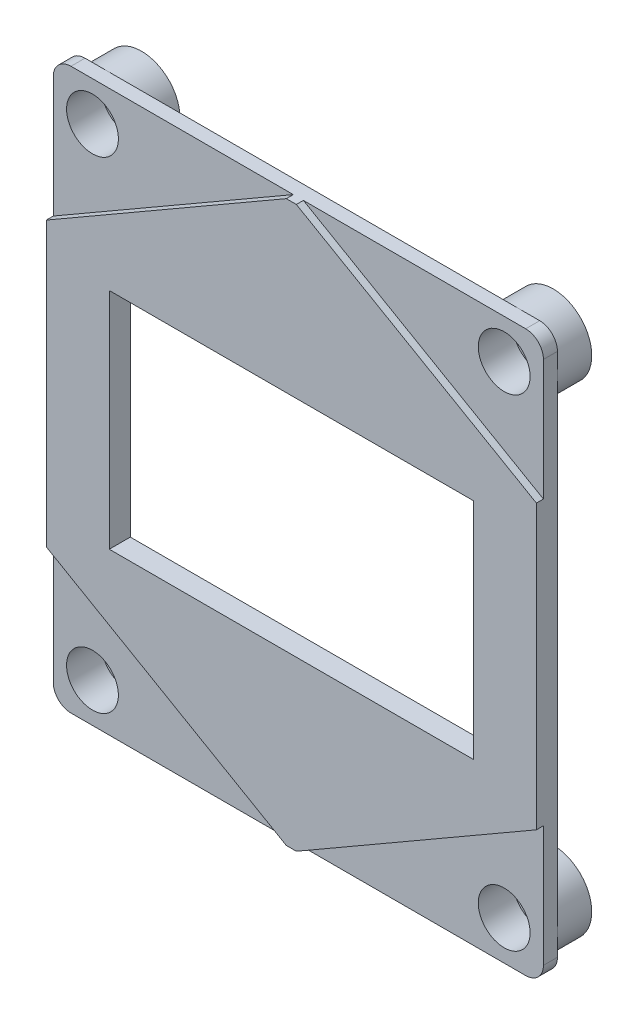
ISO-10303-21;
HEADER;
FILE_DESCRIPTION(('STEP AP214'),'2;1');
FILE_NAME('part.step','',(''),(''),'','','');
FILE_SCHEMA(('AUTOMOTIVE_DESIGN { 1 0 10303 214 1 1 1 1 }'));
ENDSEC;
DATA;
#1=APPLICATION_CONTEXT('core data for automotive mechanical design processes');
#2=APPLICATION_PROTOCOL_DEFINITION('international standard','automotive_design',2000,#1);
#3=PRODUCT_CONTEXT('',#1,'mechanical');
#4=PRODUCT('Part','Part','',(#3));
#5=PRODUCT_RELATED_PRODUCT_CATEGORY('part','',(#4));
#6=PRODUCT_DEFINITION_FORMATION('','',#4);
#7=PRODUCT_DEFINITION_CONTEXT('part definition',#1,'design');
#8=PRODUCT_DEFINITION('design','',#6,#7);
#9=PRODUCT_DEFINITION_SHAPE('','',#8);
#10=(LENGTH_UNIT() NAMED_UNIT(*) SI_UNIT(.MILLI.,.METRE.));
#11=(NAMED_UNIT(*) PLANE_ANGLE_UNIT() SI_UNIT($,.RADIAN.));
#12=(NAMED_UNIT(*) SI_UNIT($,.STERADIAN.) SOLID_ANGLE_UNIT());
#13=UNCERTAINTY_MEASURE_WITH_UNIT(LENGTH_MEASURE(1.E-05),#10,'distance_accuracy_value','');
#14=(GEOMETRIC_REPRESENTATION_CONTEXT(3) GLOBAL_UNCERTAINTY_ASSIGNED_CONTEXT((#13)) GLOBAL_UNIT_ASSIGNED_CONTEXT((#10,
#11,#12)) REPRESENTATION_CONTEXT('',''));
#15=CARTESIAN_POINT('',(0.,0.,0.));
#16=DIRECTION('',(0.,0.,1.));
#17=DIRECTION('',(1.,0.,0.));
#18=AXIS2_PLACEMENT_3D('',#15,#16,#17);
#19=CARTESIAN_POINT('',(0.,0.,1.5));
#20=DIRECTION('',(0.,0.,1.));
#21=DIRECTION('',(1.,0.,0.));
#22=AXIS2_PLACEMENT_3D('',#19,#20,#21);
#23=PLANE('',#22);
#24=DIRECTION('',(0.,1.,0.));
#25=VECTOR('',#24,1.);
#26=CARTESIAN_POINT('',(13.,0.,1.5));
#27=LINE('',#26,#25);
#28=CARTESIAN_POINT('',(13.,-8.,1.5));
#29=VERTEX_POINT('',#28);
#30=CARTESIAN_POINT('',(13.,8.,1.5));
#31=VERTEX_POINT('',#30);
#32=EDGE_CURVE('E11',#29,#31,#27,.T.);
#33=ORIENTED_EDGE('',*,*,#32,.F.);
#34=DIRECTION('',(1.,0.,0.));
#35=VECTOR('',#34,1.);
#36=CARTESIAN_POINT('',(0.,-8.,1.5));
#37=LINE('',#36,#35);
#38=CARTESIAN_POINT('',(-13.,-8.,1.5));
#39=VERTEX_POINT('',#38);
#40=EDGE_CURVE('E194',#39,#29,#37,.T.);
#41=ORIENTED_EDGE('',*,*,#40,.F.);
#42=DIRECTION('',(0.,-1.,0.));
#43=VECTOR('',#42,1.);
#44=CARTESIAN_POINT('',(-13.,0.,1.5));
#45=LINE('',#44,#43);
#46=CARTESIAN_POINT('',(-13.,8.,1.5));
#47=VERTEX_POINT('',#46);
#48=EDGE_CURVE('E314',#47,#39,#45,.T.);
#49=ORIENTED_EDGE('',*,*,#48,.F.);
#50=DIRECTION('',(-1.,0.,0.));
#51=VECTOR('',#50,1.);
#52=CARTESIAN_POINT('',(0.,8.,1.5));
#53=LINE('',#52,#51);
#54=EDGE_CURVE('E43',#31,#47,#53,.T.);
#55=ORIENTED_EDGE('',*,*,#54,.F.);
#56=EDGE_LOOP('',(#33,#41,#49,#55));
#57=FACE_BOUND('',#56,.T.);
#58=DIRECTION('',(0.866025403784439,-0.5,0.));
#59=VECTOR('',#58,1.);
#60=CARTESIAN_POINT('',(-17.5,-10.1036297108185,1.5));
#61=LINE('',#60,#59);
#62=CARTESIAN_POINT('',(-17.5,-10.1036297108185,1.5));
#63=VERTEX_POINT('',#62);
#64=CARTESIAN_POINT('',(-0.358983848622461,-20.,1.5));
#65=VERTEX_POINT('',#64);
#66=EDGE_CURVE('E421',#63,#65,#61,.T.);
#67=ORIENTED_EDGE('',*,*,#66,.T.);
#68=DIRECTION('',(1.,0.,0.));
#69=VECTOR('',#68,1.);
#70=CARTESIAN_POINT('',(0.,-20.,1.5));
#71=LINE('',#70,#69);
#72=CARTESIAN_POINT('',(0.358983848622456,-20.,1.5));
#73=VERTEX_POINT('',#72);
#74=EDGE_CURVE('E184',#65,#73,#71,.T.);
#75=ORIENTED_EDGE('',*,*,#74,.T.);
#76=DIRECTION('',(0.866025403784438,0.5,0.));
#77=VECTOR('',#76,1.);
#78=CARTESIAN_POINT('',(0.,-20.2072594216369,1.5));
#79=LINE('',#78,#77);
#80=CARTESIAN_POINT('',(17.5,-10.1036297108185,1.5));
#81=VERTEX_POINT('',#80);
#82=EDGE_CURVE('E180',#73,#81,#79,.T.);
#83=ORIENTED_EDGE('',*,*,#82,.T.);
#84=DIRECTION('',(0.,1.,0.));
#85=VECTOR('',#84,1.);
#86=CARTESIAN_POINT('',(17.5,-10.1036297108185,1.5));
#87=LINE('',#86,#85);
#88=CARTESIAN_POINT('',(17.5,10.1036297108185,1.5));
#89=VERTEX_POINT('',#88);
#90=EDGE_CURVE('E401',#81,#89,#87,.T.);
#91=ORIENTED_EDGE('',*,*,#90,.T.);
#92=DIRECTION('',(-0.866025403784439,0.5,0.));
#93=VECTOR('',#92,1.);
#94=CARTESIAN_POINT('',(17.5,10.1036297108185,1.5));
#95=LINE('',#94,#93);
#96=CARTESIAN_POINT('',(0.358983848622456,20.,1.5));
#97=VERTEX_POINT('',#96);
#98=EDGE_CURVE('E412',#89,#97,#95,.T.);
#99=ORIENTED_EDGE('',*,*,#98,.T.);
#100=DIRECTION('',(1.,0.,0.));
#101=VECTOR('',#100,1.);
#102=CARTESIAN_POINT('',(0.,20.,1.5));
#103=LINE('',#102,#101);
#104=CARTESIAN_POINT('',(-0.358983848622461,20.,1.5));
#105=VERTEX_POINT('',#104);
#106=EDGE_CURVE('E418',#105,#97,#103,.T.);
#107=ORIENTED_EDGE('',*,*,#106,.F.);
#108=DIRECTION('',(-0.866025403784438,-0.5,0.));
#109=VECTOR('',#108,1.);
#110=CARTESIAN_POINT('',(0.,20.2072594216369,1.5));
#111=LINE('',#110,#109);
#112=CARTESIAN_POINT('',(-17.5,10.1036297108184,1.5));
#113=VERTEX_POINT('',#112);
#114=EDGE_CURVE('E426',#105,#113,#111,.T.);
#115=ORIENTED_EDGE('',*,*,#114,.T.);
#116=DIRECTION('',(0.,-1.,0.));
#117=VECTOR('',#116,1.);
#118=CARTESIAN_POINT('',(-17.5,10.1036297108184,1.5));
#119=LINE('',#118,#117);
#120=EDGE_CURVE('E424',#113,#63,#119,.T.);
#121=ORIENTED_EDGE('',*,*,#120,.T.);
#122=EDGE_LOOP('',(#67,#75,#83,#91,#99,#107,#115,#121));
#123=FACE_BOUND('',#122,.T.);
#124=ADVANCED_FACE('F35',(#57,#123),#23,.T.);
#125=CARTESIAN_POINT('',(0.,-20.2072594216369,1.5));
#126=DIRECTION('',(-0.5,0.866025403784439,0.));
#127=DIRECTION('',(-0.866025403784439,-0.5,0.));
#128=AXIS2_PLACEMENT_3D('',#125,#126,#127);
#129=PLANE('',#128);
#130=DIRECTION('',(0.,0.,-1.));
#131=VECTOR('',#130,1.);
#132=CARTESIAN_POINT('',(0.358983848622456,-20.,6.));
#133=LINE('',#132,#131);
#134=CARTESIAN_POINT('',(0.358983848622456,-20.,1.));
#135=VERTEX_POINT('',#134);
#136=EDGE_CURVE('E174',#73,#135,#133,.T.);
#137=ORIENTED_EDGE('',*,*,#136,.T.);
#138=DIRECTION('',(0.866025403784438,0.5,0.));
#139=VECTOR('',#138,1.);
#140=CARTESIAN_POINT('',(0.,-20.2072594216369,1.));
#141=LINE('',#140,#139);
#142=CARTESIAN_POINT('',(17.5,-10.1036297108184,1.));
#143=VERTEX_POINT('',#142);
#144=EDGE_CURVE('E178',#135,#143,#141,.T.);
#145=ORIENTED_EDGE('',*,*,#144,.T.);
#146=DIRECTION('',(0.,0.,-1.));
#147=VECTOR('',#146,1.);
#148=CARTESIAN_POINT('',(17.5,-10.1036297108185,1.5));
#149=LINE('',#148,#147);
#150=EDGE_CURVE('E399',#81,#143,#149,.T.);
#151=ORIENTED_EDGE('',*,*,#150,.F.);
#152=ORIENTED_EDGE('',*,*,#82,.F.);
#153=EDGE_LOOP('',(#137,#145,#151,#152));
#154=FACE_BOUND('',#153,.T.);
#155=ADVANCED_FACE('F176',(#154),#129,.F.);
#156=CARTESIAN_POINT('',(-17.5,-10.1036297108185,1.5));
#157=DIRECTION('',(0.5,0.866025403784439,0.));
#158=DIRECTION('',(-0.866025403784439,0.5,0.));
#159=AXIS2_PLACEMENT_3D('',#156,#157,#158);
#160=PLANE('',#159);
#161=DIRECTION('',(0.,0.,-1.));
#162=VECTOR('',#161,1.);
#163=CARTESIAN_POINT('',(-0.358983848622461,-20.,6.));
#164=LINE('',#163,#162);
#165=CARTESIAN_POINT('',(-0.358983848622478,-20.,1.));
#166=VERTEX_POINT('',#165);
#167=EDGE_CURVE('E185',#65,#166,#164,.T.);
#168=ORIENTED_EDGE('',*,*,#167,.F.);
#169=ORIENTED_EDGE('',*,*,#66,.F.);
#170=DIRECTION('',(0.,0.,-1.));
#171=VECTOR('',#170,1.);
#172=CARTESIAN_POINT('',(-17.5,-10.1036297108185,1.5));
#173=LINE('',#172,#171);
#174=CARTESIAN_POINT('',(-17.5,-10.1036297108185,1.));
#175=VERTEX_POINT('',#174);
#176=EDGE_CURVE('E402',#63,#175,#173,.T.);
#177=ORIENTED_EDGE('',*,*,#176,.T.);
#178=DIRECTION('',(0.866025403784439,-0.5,0.));
#179=VECTOR('',#178,1.);
#180=CARTESIAN_POINT('',(-17.5,-10.1036297108185,1.));
#181=LINE('',#180,#179);
#182=EDGE_CURVE('E409',#175,#166,#181,.T.);
#183=ORIENTED_EDGE('',*,*,#182,.T.);
#184=EDGE_LOOP('',(#168,#169,#177,#183));
#185=FACE_BOUND('',#184,.T.);
#186=ADVANCED_FACE('F443',(#185),#160,.F.);
#187=CARTESIAN_POINT('',(0.,0.,1.));
#188=DIRECTION('',(0.,0.,1.));
#189=DIRECTION('',(1.,0.,0.));
#190=AXIS2_PLACEMENT_3D('',#187,#188,#189);
#191=PLANE('',#190);
#192=DIRECTION('',(-0.866025403784439,0.5,0.));
#193=VECTOR('',#192,1.);
#194=CARTESIAN_POINT('',(17.5,10.1036297108185,1.));
#195=LINE('',#194,#193);
#196=CARTESIAN_POINT('',(17.5,10.1036297108185,1.));
#197=VERTEX_POINT('',#196);
#198=CARTESIAN_POINT('',(0.358983848622456,20.,1.));
#199=VERTEX_POINT('',#198);
#200=EDGE_CURVE('E413',#197,#199,#195,.T.);
#201=ORIENTED_EDGE('',*,*,#200,.F.);
#202=DIRECTION('',(0.,1.,0.));
#203=VECTOR('',#202,1.);
#204=CARTESIAN_POINT('',(17.5,-20.,1.));
#205=LINE('',#204,#203);
#206=CARTESIAN_POINT('',(17.5,18.735,1.));
#207=VERTEX_POINT('',#206);
#208=EDGE_CURVE('E207',#197,#207,#205,.T.);
#209=ORIENTED_EDGE('',*,*,#208,.T.);
#210=CARTESIAN_POINT('',(16.235,18.735,1.));
#211=DIRECTION('',(0.,0.,1.));
#212=DIRECTION('',(1.,0.,0.));
#213=AXIS2_PLACEMENT_3D('',#210,#211,#212);
#214=CIRCLE('',#213,1.265);
#215=CARTESIAN_POINT('',(16.235,20.,1.));
#216=VERTEX_POINT('',#215);
#217=EDGE_CURVE('E256',#207,#216,#214,.T.);
#218=ORIENTED_EDGE('',*,*,#217,.T.);
#219=DIRECTION('',(-1.,0.,0.));
#220=VECTOR('',#219,1.);
#221=CARTESIAN_POINT('',(17.5,20.,1.));
#222=LINE('',#221,#220);
#223=EDGE_CURVE('E214',#216,#199,#222,.T.);
#224=ORIENTED_EDGE('',*,*,#223,.T.);
#225=EDGE_LOOP('',(#201,#209,#218,#224));
#226=FACE_BOUND('',#225,.T.);
#227=CARTESIAN_POINT('',(14.7,17.2,1.));
#228=DIRECTION('',(0.,0.,1.));
#229=DIRECTION('',(1.,0.,0.));
#230=AXIS2_PLACEMENT_3D('',#227,#228,#229);
#231=CIRCLE('',#230,1.85);
#232=CARTESIAN_POINT('',(16.55,17.2,1.));
#233=VERTEX_POINT('',#232);
#234=EDGE_CURVE('E367',#233,#233,#231,.T.);
#235=ORIENTED_EDGE('',*,*,#234,.F.);
#236=EDGE_LOOP('',(#235));
#237=FACE_BOUND('',#236,.T.);
#238=ADVANCED_FACE('F474',(#226,#237),#191,.T.);
#239=ORIENTED_EDGE('',*,*,#144,.F.);
#240=DIRECTION('',(1.,0.,0.));
#241=VECTOR('',#240,1.);
#242=CARTESIAN_POINT('',(17.5,-20.,1.));
#243=LINE('',#242,#241);
#244=CARTESIAN_POINT('',(16.235,-20.,1.));
#245=VERTEX_POINT('',#244);
#246=EDGE_CURVE('E190',#135,#245,#243,.T.);
#247=ORIENTED_EDGE('',*,*,#246,.T.);
#248=CARTESIAN_POINT('',(16.235,-18.735,1.));
#249=DIRECTION('',(0.,0.,1.));
#250=DIRECTION('',(1.,0.,0.));
#251=AXIS2_PLACEMENT_3D('',#248,#249,#250);
#252=CIRCLE('',#251,1.265);
#253=CARTESIAN_POINT('',(17.5,-18.735,1.));
#254=VERTEX_POINT('',#253);
#255=EDGE_CURVE('E258',#245,#254,#252,.T.);
#256=ORIENTED_EDGE('',*,*,#255,.T.);
#257=EDGE_CURVE('E193',#254,#143,#205,.T.);
#258=ORIENTED_EDGE('',*,*,#257,.T.);
#259=EDGE_LOOP('',(#239,#247,#256,#258));
#260=FACE_BOUND('',#259,.T.);
#261=CARTESIAN_POINT('',(14.7,-17.2,1.));
#262=DIRECTION('',(0.,0.,-1.));
#263=DIRECTION('',(1.,0.,0.));
#264=AXIS2_PLACEMENT_3D('',#261,#262,#263);
#265=CIRCLE('',#264,1.85);
#266=CARTESIAN_POINT('',(16.55,-17.2,1.));
#267=VERTEX_POINT('',#266);
#268=EDGE_CURVE('E330',#267,#267,#265,.T.);
#269=ORIENTED_EDGE('',*,*,#268,.T.);
#270=EDGE_LOOP('',(#269));
#271=FACE_BOUND('',#270,.T.);
#272=ADVANCED_FACE('F188',(#260,#271),#191,.T.);
#273=ORIENTED_EDGE('',*,*,#182,.F.);
#274=DIRECTION('',(0.,-1.,0.));
#275=VECTOR('',#274,1.);
#276=CARTESIAN_POINT('',(-17.5,-20.,1.));
#277=LINE('',#276,#275);
#278=CARTESIAN_POINT('',(-17.5,-18.735,1.));
#279=VERTEX_POINT('',#278);
#280=EDGE_CURVE('E208',#175,#279,#277,.T.);
#281=ORIENTED_EDGE('',*,*,#280,.T.);
#282=CARTESIAN_POINT('',(-16.235,-18.735,1.));
#283=DIRECTION('',(0.,0.,1.));
#284=DIRECTION('',(1.,0.,0.));
#285=AXIS2_PLACEMENT_3D('',#282,#283,#284);
#286=CIRCLE('',#285,1.265);
#287=CARTESIAN_POINT('',(-16.235,-20.,1.));
#288=VERTEX_POINT('',#287);
#289=EDGE_CURVE('E260',#279,#288,#286,.T.);
#290=ORIENTED_EDGE('',*,*,#289,.T.);
#291=EDGE_CURVE('E203',#288,#166,#243,.T.);
#292=ORIENTED_EDGE('',*,*,#291,.T.);
#293=EDGE_LOOP('',(#273,#281,#290,#292));
#294=FACE_BOUND('',#293,.T.);
#295=CARTESIAN_POINT('',(-14.7,-17.2,1.));
#296=DIRECTION('',(0.,0.,1.));
#297=DIRECTION('',(-1.,0.,0.));
#298=AXIS2_PLACEMENT_3D('',#295,#296,#297);
#299=CIRCLE('',#298,1.85);
#300=CARTESIAN_POINT('',(-16.55,-17.2,1.));
#301=VERTEX_POINT('',#300);
#302=EDGE_CURVE('E300',#301,#301,#299,.T.);
#303=ORIENTED_EDGE('',*,*,#302,.F.);
#304=EDGE_LOOP('',(#303));
#305=FACE_BOUND('',#304,.T.);
#306=ADVANCED_FACE('F439',(#294,#305),#191,.T.);
#307=CARTESIAN_POINT('',(14.7,-17.2,-0.5));
#308=DIRECTION('',(0.,0.,-1.));
#309=DIRECTION('',(-1.,0.,0.));
#310=AXIS2_PLACEMENT_3D('',#307,#308,#309);
#311=CYLINDRICAL_SURFACE('',#310,1.1);
#312=CARTESIAN_POINT('',(14.7,-17.2,-2.5));
#313=DIRECTION('',(0.,0.,-1.));
#314=DIRECTION('',(-1.,0.,0.));
#315=AXIS2_PLACEMENT_3D('',#312,#313,#314);
#316=CIRCLE('',#315,1.1);
#317=CARTESIAN_POINT('',(13.6,-17.2,-2.5));
#318=VERTEX_POINT('',#317);
#319=EDGE_CURVE('E278',#318,#318,#316,.F.);
#320=ORIENTED_EDGE('',*,*,#319,.F.);
#321=EDGE_LOOP('',(#320));
#322=FACE_BOUND('',#321,.T.);
#323=CARTESIAN_POINT('',(14.7,-17.2,-1.5));
#324=DIRECTION('',(0.,0.,1.));
#325=DIRECTION('',(1.,0.,0.));
#326=AXIS2_PLACEMENT_3D('',#323,#324,#325);
#327=CIRCLE('',#326,1.1);
#328=CARTESIAN_POINT('',(15.8,-17.2,-1.5));
#329=VERTEX_POINT('',#328);
#330=EDGE_CURVE('E297',#329,#329,#327,.T.);
#331=ORIENTED_EDGE('',*,*,#330,.T.);
#332=EDGE_LOOP('',(#331));
#333=FACE_BOUND('',#332,.T.);
#334=ADVANCED_FACE('F526',(#322,#333),#311,.F.);
#335=CARTESIAN_POINT('',(-14.7,-17.2,-0.5));
#336=DIRECTION('',(0.,0.,-1.));
#337=DIRECTION('',(-1.,0.,0.));
#338=AXIS2_PLACEMENT_3D('',#335,#336,#337);
#339=CYLINDRICAL_SURFACE('',#338,1.1);
#340=CARTESIAN_POINT('',(-14.7,-17.2,-2.5));
#341=DIRECTION('',(0.,0.,-1.));
#342=DIRECTION('',(-1.,0.,0.));
#343=AXIS2_PLACEMENT_3D('',#340,#341,#342);
#344=CIRCLE('',#343,1.1);
#345=CARTESIAN_POINT('',(-15.8,-17.2,-2.5));
#346=VERTEX_POINT('',#345);
#347=EDGE_CURVE('E282',#346,#346,#344,.T.);
#348=ORIENTED_EDGE('',*,*,#347,.T.);
#349=EDGE_LOOP('',(#348));
#350=FACE_BOUND('',#349,.T.);
#351=CARTESIAN_POINT('',(-14.7,-17.2,-1.5));
#352=DIRECTION('',(0.,0.,1.));
#353=DIRECTION('',(1.,0.,0.));
#354=AXIS2_PLACEMENT_3D('',#351,#352,#353);
#355=CIRCLE('',#354,1.1);
#356=CARTESIAN_POINT('',(-13.6,-17.2,-1.5));
#357=VERTEX_POINT('',#356);
#358=EDGE_CURVE('E292',#357,#357,#355,.F.);
#359=ORIENTED_EDGE('',*,*,#358,.F.);
#360=EDGE_LOOP('',(#359));
#361=FACE_BOUND('',#360,.T.);
#362=ADVANCED_FACE('F522',(#350,#361),#339,.F.);
#363=CARTESIAN_POINT('',(-14.7,17.2,-0.5));
#364=DIRECTION('',(0.,0.,-1.));
#365=DIRECTION('',(-1.,0.,0.));
#366=AXIS2_PLACEMENT_3D('',#363,#364,#365);
#367=CYLINDRICAL_SURFACE('',#366,1.1);
#368=CARTESIAN_POINT('',(-14.7,17.2,-2.5));
#369=DIRECTION('',(0.,0.,-1.));
#370=DIRECTION('',(-1.,0.,0.));
#371=AXIS2_PLACEMENT_3D('',#368,#369,#370);
#372=CIRCLE('',#371,1.1);
#373=CARTESIAN_POINT('',(-15.8,17.2,-2.5));
#374=VERTEX_POINT('',#373);
#375=EDGE_CURVE('E285',#374,#374,#372,.F.);
#376=ORIENTED_EDGE('',*,*,#375,.F.);
#377=EDGE_LOOP('',(#376));
#378=FACE_BOUND('',#377,.T.);
#379=CARTESIAN_POINT('',(-14.7,17.2,-1.5));
#380=DIRECTION('',(0.,0.,1.));
#381=DIRECTION('',(1.,0.,0.));
#382=AXIS2_PLACEMENT_3D('',#379,#380,#381);
#383=CIRCLE('',#382,1.1);
#384=CARTESIAN_POINT('',(-13.6,17.2,-1.5));
#385=VERTEX_POINT('',#384);
#386=EDGE_CURVE('E288',#385,#385,#383,.T.);
#387=ORIENTED_EDGE('',*,*,#386,.T.);
#388=EDGE_LOOP('',(#387));
#389=FACE_BOUND('',#388,.T.);
#390=ADVANCED_FACE('F519',(#378,#389),#367,.F.);
#391=CARTESIAN_POINT('',(-17.5,-20.,1.));
#392=DIRECTION('',(1.,0.,0.));
#393=DIRECTION('',(0.,0.,-1.));
#394=AXIS2_PLACEMENT_3D('',#391,#392,#393);
#395=PLANE('',#394);
#396=DIRECTION('',(0.,-1.,0.));
#397=VECTOR('',#396,1.);
#398=CARTESIAN_POINT('',(-17.5,-20.,0.));
#399=LINE('',#398,#397);
#400=CARTESIAN_POINT('',(-17.5,18.735,0.));
#401=VERTEX_POINT('',#400);
#402=CARTESIAN_POINT('',(-17.5,-18.735,0.));
#403=VERTEX_POINT('',#402);
#404=EDGE_CURVE('E217',#401,#403,#399,.T.);
#405=ORIENTED_EDGE('',*,*,#404,.T.);
#406=DIRECTION('',(0.,0.,-1.));
#407=VECTOR('',#406,1.);
#408=CARTESIAN_POINT('',(-17.5,-18.735,1.));
#409=LINE('',#408,#407);
#410=EDGE_CURVE('E251',#403,#279,#409,.F.);
#411=ORIENTED_EDGE('',*,*,#410,.T.);
#412=ORIENTED_EDGE('',*,*,#280,.F.);
#413=ORIENTED_EDGE('',*,*,#176,.F.);
#414=ORIENTED_EDGE('',*,*,#120,.F.);
#415=DIRECTION('',(0.,0.,-1.));
#416=VECTOR('',#415,1.);
#417=CARTESIAN_POINT('',(-17.5,10.1036297108184,1.5));
#418=LINE('',#417,#416);
#419=CARTESIAN_POINT('',(-17.5,10.1036297108184,1.));
#420=VERTEX_POINT('',#419);
#421=EDGE_CURVE('E337',#113,#420,#418,.T.);
#422=ORIENTED_EDGE('',*,*,#421,.T.);
#423=CARTESIAN_POINT('',(-17.5,18.735,1.));
#424=VERTEX_POINT('',#423);
#425=EDGE_CURVE('E204',#424,#420,#277,.T.);
#426=ORIENTED_EDGE('',*,*,#425,.F.);
#427=DIRECTION('',(0.,0.,-1.));
#428=VECTOR('',#427,1.);
#429=CARTESIAN_POINT('',(-17.5,18.735,1.));
#430=LINE('',#429,#428);
#431=EDGE_CURVE('E248',#424,#401,#430,.T.);
#432=ORIENTED_EDGE('',*,*,#431,.T.);
#433=EDGE_LOOP('',(#405,#411,#412,#413,#414,#422,#426,#432));
#434=FACE_BOUND('',#433,.T.);
#435=ADVANCED_FACE('F447',(#434),#395,.F.);
#436=CARTESIAN_POINT('',(17.5,-20.,1.));
#437=DIRECTION('',(0.,1.,0.));
#438=DIRECTION('',(-1.,0.,0.));
#439=AXIS2_PLACEMENT_3D('',#436,#437,#438);
#440=PLANE('',#439);
#441=ORIENTED_EDGE('',*,*,#291,.F.);
#442=DIRECTION('',(0.,0.,-1.));
#443=VECTOR('',#442,1.);
#444=CARTESIAN_POINT('',(-16.235,-20.,1.));
#445=LINE('',#444,#443);
#446=CARTESIAN_POINT('',(-16.235,-20.,0.));
#447=VERTEX_POINT('',#446);
#448=EDGE_CURVE('E237',#288,#447,#445,.T.);
#449=ORIENTED_EDGE('',*,*,#448,.T.);
#450=DIRECTION('',(1.,0.,0.));
#451=VECTOR('',#450,1.);
#452=CARTESIAN_POINT('',(17.5,-20.,0.));
#453=LINE('',#452,#451);
#454=CARTESIAN_POINT('',(16.235,-20.,0.));
#455=VERTEX_POINT('',#454);
#456=EDGE_CURVE('E220',#447,#455,#453,.T.);
#457=ORIENTED_EDGE('',*,*,#456,.T.);
#458=DIRECTION('',(0.,0.,-1.));
#459=VECTOR('',#458,1.);
#460=CARTESIAN_POINT('',(16.235,-20.,1.));
#461=LINE('',#460,#459);
#462=EDGE_CURVE('E201',#455,#245,#461,.F.);
#463=ORIENTED_EDGE('',*,*,#462,.T.);
#464=ORIENTED_EDGE('',*,*,#246,.F.);
#465=ORIENTED_EDGE('',*,*,#136,.F.);
#466=ORIENTED_EDGE('',*,*,#74,.F.);
#467=ORIENTED_EDGE('',*,*,#167,.T.);
#468=EDGE_LOOP('',(#441,#449,#457,#463,#464,#465,#466,#467));
#469=FACE_BOUND('',#468,.T.);
#470=ADVANCED_FACE('F198',(#469),#440,.F.);
#471=CARTESIAN_POINT('',(17.5,-20.,1.));
#472=DIRECTION('',(-1.,0.,0.));
#473=DIRECTION('',(0.,0.,1.));
#474=AXIS2_PLACEMENT_3D('',#471,#472,#473);
#475=PLANE('',#474);
#476=ORIENTED_EDGE('',*,*,#257,.F.);
#477=DIRECTION('',(0.,0.,-1.));
#478=VECTOR('',#477,1.);
#479=CARTESIAN_POINT('',(17.5,-18.735,1.));
#480=LINE('',#479,#478);
#481=CARTESIAN_POINT('',(17.5,-18.735,0.));
#482=VERTEX_POINT('',#481);
#483=EDGE_CURVE('E265',#254,#482,#480,.T.);
#484=ORIENTED_EDGE('',*,*,#483,.T.);
#485=DIRECTION('',(0.,1.,0.));
#486=VECTOR('',#485,1.);
#487=CARTESIAN_POINT('',(17.5,-20.,0.));
#488=LINE('',#487,#486);
#489=CARTESIAN_POINT('',(17.5,18.735,0.));
#490=VERTEX_POINT('',#489);
#491=EDGE_CURVE('E223',#482,#490,#488,.T.);
#492=ORIENTED_EDGE('',*,*,#491,.T.);
#493=DIRECTION('',(0.,0.,-1.));
#494=VECTOR('',#493,1.);
#495=CARTESIAN_POINT('',(17.5,18.735,1.));
#496=LINE('',#495,#494);
#497=EDGE_CURVE('E262',#490,#207,#496,.F.);
#498=ORIENTED_EDGE('',*,*,#497,.T.);
#499=ORIENTED_EDGE('',*,*,#208,.F.);
#500=DIRECTION('',(0.,0.,-1.));
#501=VECTOR('',#500,1.);
#502=CARTESIAN_POINT('',(17.5,10.1036297108185,1.5));
#503=LINE('',#502,#501);
#504=EDGE_CURVE('E403',#89,#197,#503,.T.);
#505=ORIENTED_EDGE('',*,*,#504,.F.);
#506=ORIENTED_EDGE('',*,*,#90,.F.);
#507=ORIENTED_EDGE('',*,*,#150,.T.);
#508=EDGE_LOOP('',(#476,#484,#492,#498,#499,#505,#506,#507));
#509=FACE_BOUND('',#508,.T.);
#510=ADVANCED_FACE('F397',(#509),#475,.F.);
#511=CARTESIAN_POINT('',(17.5,20.,1.));
#512=DIRECTION('',(0.,-1.,0.));
#513=DIRECTION('',(1.,0.,0.));
#514=AXIS2_PLACEMENT_3D('',#511,#512,#513);
#515=PLANE('',#514);
#516=ORIENTED_EDGE('',*,*,#223,.F.);
#517=DIRECTION('',(0.,0.,-1.));
#518=VECTOR('',#517,1.);
#519=CARTESIAN_POINT('',(16.235,20.,1.));
#520=LINE('',#519,#518);
#521=CARTESIAN_POINT('',(16.235,20.,0.));
#522=VERTEX_POINT('',#521);
#523=EDGE_CURVE('E271',#216,#522,#520,.T.);
#524=ORIENTED_EDGE('',*,*,#523,.T.);
#525=DIRECTION('',(-1.,0.,0.));
#526=VECTOR('',#525,1.);
#527=CARTESIAN_POINT('',(17.5,20.,0.));
#528=LINE('',#527,#526);
#529=CARTESIAN_POINT('',(-16.235,20.,0.));
#530=VERTEX_POINT('',#529);
#531=EDGE_CURVE('E226',#522,#530,#528,.T.);
#532=ORIENTED_EDGE('',*,*,#531,.T.);
#533=DIRECTION('',(0.,0.,-1.));
#534=VECTOR('',#533,1.);
#535=CARTESIAN_POINT('',(-16.235,20.,1.));
#536=LINE('',#535,#534);
#537=CARTESIAN_POINT('',(-16.235,20.,1.));
#538=VERTEX_POINT('',#537);
#539=EDGE_CURVE('E268',#530,#538,#536,.F.);
#540=ORIENTED_EDGE('',*,*,#539,.T.);
#541=CARTESIAN_POINT('',(-0.358983848622461,20.,1.));
#542=VERTEX_POINT('',#541);
#543=EDGE_CURVE('E213',#542,#538,#222,.T.);
#544=ORIENTED_EDGE('',*,*,#543,.F.);
#545=DIRECTION('',(0.,0.,-1.));
#546=VECTOR('',#545,1.);
#547=CARTESIAN_POINT('',(-0.358983848622461,20.,6.));
#548=LINE('',#547,#546);
#549=EDGE_CURVE('E431',#105,#542,#548,.T.);
#550=ORIENTED_EDGE('',*,*,#549,.F.);
#551=ORIENTED_EDGE('',*,*,#106,.T.);
#552=DIRECTION('',(0.,0.,-1.));
#553=VECTOR('',#552,1.);
#554=CARTESIAN_POINT('',(0.358983848622456,20.,6.));
#555=LINE('',#554,#553);
#556=EDGE_CURVE('E58',#97,#199,#555,.T.);
#557=ORIENTED_EDGE('',*,*,#556,.T.);
#558=EDGE_LOOP('',(#516,#524,#532,#540,#544,#550,#551,#557));
#559=FACE_BOUND('',#558,.T.);
#560=ADVANCED_FACE('F565',(#559),#515,.F.);
#561=DIRECTION('',(-0.866025403784438,-0.5,0.));
#562=VECTOR('',#561,1.);
#563=CARTESIAN_POINT('',(0.,20.2072594216369,1.));
#564=LINE('',#563,#562);
#565=EDGE_CURVE('E195',#542,#420,#564,.T.);
#566=ORIENTED_EDGE('',*,*,#565,.F.);
#567=ORIENTED_EDGE('',*,*,#543,.T.);
#568=CARTESIAN_POINT('',(-16.235,18.735,1.));
#569=DIRECTION('',(0.,0.,1.));
#570=DIRECTION('',(1.,0.,0.));
#571=AXIS2_PLACEMENT_3D('',#568,#569,#570);
#572=CIRCLE('',#571,1.265);
#573=EDGE_CURVE('E254',#538,#424,#572,.T.);
#574=ORIENTED_EDGE('',*,*,#573,.T.);
#575=ORIENTED_EDGE('',*,*,#425,.T.);
#576=EDGE_LOOP('',(#566,#567,#574,#575));
#577=FACE_BOUND('',#576,.T.);
#578=CARTESIAN_POINT('',(-14.7,17.2,1.));
#579=DIRECTION('',(0.,0.,-1.));
#580=DIRECTION('',(-1.,0.,0.));
#581=AXIS2_PLACEMENT_3D('',#578,#579,#580);
#582=CIRCLE('',#581,1.85);
#583=CARTESIAN_POINT('',(-16.55,17.2,1.));
#584=VERTEX_POINT('',#583);
#585=EDGE_CURVE('E295',#584,#584,#582,.T.);
#586=ORIENTED_EDGE('',*,*,#585,.T.);
#587=EDGE_LOOP('',(#586));
#588=FACE_BOUND('',#587,.T.);
#589=ADVANCED_FACE('F386',(#577,#588),#191,.T.);
#590=CARTESIAN_POINT('',(0.,0.,0.));
#591=DIRECTION('',(0.,0.,1.));
#592=DIRECTION('',(1.,0.,0.));
#593=AXIS2_PLACEMENT_3D('',#590,#591,#592);
#594=PLANE('',#593);
#595=DIRECTION('',(-1.,0.,0.));
#596=VECTOR('',#595,1.);
#597=CARTESIAN_POINT('',(0.,8.,0.));
#598=LINE('',#597,#596);
#599=CARTESIAN_POINT('',(13.,8.,0.));
#600=VERTEX_POINT('',#599);
#601=CARTESIAN_POINT('',(-13.,8.,0.));
#602=VERTEX_POINT('',#601);
#603=EDGE_CURVE('E307',#600,#602,#598,.T.);
#604=ORIENTED_EDGE('',*,*,#603,.T.);
#605=DIRECTION('',(0.,-1.,0.));
#606=VECTOR('',#605,1.);
#607=CARTESIAN_POINT('',(-13.,0.,0.));
#608=LINE('',#607,#606);
#609=CARTESIAN_POINT('',(-13.,-8.,0.));
#610=VERTEX_POINT('',#609);
#611=EDGE_CURVE('E310',#602,#610,#608,.T.);
#612=ORIENTED_EDGE('',*,*,#611,.T.);
#613=DIRECTION('',(1.,0.,0.));
#614=VECTOR('',#613,1.);
#615=CARTESIAN_POINT('',(0.,-8.,0.));
#616=LINE('',#615,#614);
#617=CARTESIAN_POINT('',(13.,-8.,0.));
#618=VERTEX_POINT('',#617);
#619=EDGE_CURVE('E277',#610,#618,#616,.T.);
#620=ORIENTED_EDGE('',*,*,#619,.T.);
#621=DIRECTION('',(0.,1.,0.));
#622=VECTOR('',#621,1.);
#623=CARTESIAN_POINT('',(13.,0.,0.));
#624=LINE('',#623,#622);
#625=EDGE_CURVE('E304',#618,#600,#624,.T.);
#626=ORIENTED_EDGE('',*,*,#625,.T.);
#627=EDGE_LOOP('',(#604,#612,#620,#626));
#628=FACE_BOUND('',#627,.T.);
#629=CARTESIAN_POINT('',(14.7,-17.2,0.));
#630=DIRECTION('',(0.,0.,1.));
#631=DIRECTION('',(-1.,0.,0.));
#632=AXIS2_PLACEMENT_3D('',#629,#630,#631);
#633=CIRCLE('',#632,2.75);
#634=CARTESIAN_POINT('',(11.95,-17.2,0.));
#635=VERTEX_POINT('',#634);
#636=EDGE_CURVE('E281',#635,#635,#633,.T.);
#637=ORIENTED_EDGE('',*,*,#636,.T.);
#638=EDGE_LOOP('',(#637));
#639=FACE_BOUND('',#638,.T.);
#640=CARTESIAN_POINT('',(-14.7,-17.2,0.));
#641=DIRECTION('',(0.,0.,1.));
#642=DIRECTION('',(1.,0.,0.));
#643=AXIS2_PLACEMENT_3D('',#640,#641,#642);
#644=CIRCLE('',#643,2.75);
#645=CARTESIAN_POINT('',(-11.95,-17.2,0.));
#646=VERTEX_POINT('',#645);
#647=EDGE_CURVE('E274',#646,#646,#644,.F.);
#648=ORIENTED_EDGE('',*,*,#647,.F.);
#649=EDGE_LOOP('',(#648));
#650=FACE_BOUND('',#649,.T.);
#651=CARTESIAN_POINT('',(-14.7,17.2,0.));
#652=DIRECTION('',(0.,0.,1.));
#653=DIRECTION('',(1.,0.,0.));
#654=AXIS2_PLACEMENT_3D('',#651,#652,#653);
#655=CIRCLE('',#654,2.75);
#656=CARTESIAN_POINT('',(-11.95,17.2,0.));
#657=VERTEX_POINT('',#656);
#658=EDGE_CURVE('E360',#657,#657,#655,.T.);
#659=ORIENTED_EDGE('',*,*,#658,.T.);
#660=EDGE_LOOP('',(#659));
#661=FACE_BOUND('',#660,.T.);
#662=CARTESIAN_POINT('',(14.7,17.2,0.));
#663=DIRECTION('',(0.,0.,1.));
#664=DIRECTION('',(1.,0.,0.));
#665=AXIS2_PLACEMENT_3D('',#662,#663,#664);
#666=CIRCLE('',#665,2.75);
#667=CARTESIAN_POINT('',(17.45,17.2,0.));
#668=VERTEX_POINT('',#667);
#669=EDGE_CURVE('E216',#668,#668,#666,.F.);
#670=ORIENTED_EDGE('',*,*,#669,.F.);
#671=EDGE_LOOP('',(#670));
#672=FACE_BOUND('',#671,.T.);
#673=ORIENTED_EDGE('',*,*,#456,.F.);
#674=CARTESIAN_POINT('',(-16.235,-18.735,0.));
#675=DIRECTION('',(0.,0.,1.));
#676=DIRECTION('',(1.,0.,0.));
#677=AXIS2_PLACEMENT_3D('',#674,#675,#676);
#678=CIRCLE('',#677,1.265);
#679=EDGE_CURVE('E246',#447,#403,#678,.F.);
#680=ORIENTED_EDGE('',*,*,#679,.T.);
#681=ORIENTED_EDGE('',*,*,#404,.F.);
#682=CARTESIAN_POINT('',(-16.235,18.735,0.));
#683=DIRECTION('',(0.,0.,1.));
#684=DIRECTION('',(1.,0.,0.));
#685=AXIS2_PLACEMENT_3D('',#682,#683,#684);
#686=CIRCLE('',#685,1.265);
#687=EDGE_CURVE('E240',#401,#530,#686,.F.);
#688=ORIENTED_EDGE('',*,*,#687,.T.);
#689=ORIENTED_EDGE('',*,*,#531,.F.);
#690=CARTESIAN_POINT('',(16.235,18.735,0.));
#691=DIRECTION('',(0.,0.,1.));
#692=DIRECTION('',(1.,0.,0.));
#693=AXIS2_PLACEMENT_3D('',#690,#691,#692);
#694=CIRCLE('',#693,1.265);
#695=EDGE_CURVE('E242',#522,#490,#694,.F.);
#696=ORIENTED_EDGE('',*,*,#695,.T.);
#697=ORIENTED_EDGE('',*,*,#491,.F.);
#698=CARTESIAN_POINT('',(16.235,-18.735,0.));
#699=DIRECTION('',(0.,0.,1.));
#700=DIRECTION('',(1.,0.,0.));
#701=AXIS2_PLACEMENT_3D('',#698,#699,#700);
#702=CIRCLE('',#701,1.265);
#703=EDGE_CURVE('E244',#482,#455,#702,.F.);
#704=ORIENTED_EDGE('',*,*,#703,.T.);
#705=EDGE_LOOP('',(#673,#680,#681,#688,#689,#696,#697,#704));
#706=FACE_BOUND('',#705,.T.);
#707=ADVANCED_FACE('F380',(#628,#639,#650,#661,#672,#706),#594,.F.);
#708=CARTESIAN_POINT('',(14.7,17.2,-2.5));
#709=DIRECTION('',(0.,0.,1.));
#710=DIRECTION('',(1.,0.,0.));
#711=AXIS2_PLACEMENT_3D('',#708,#709,#710);
#712=CYLINDRICAL_SURFACE('',#711,2.75);
#713=CARTESIAN_POINT('',(14.7,17.2,-2.5));
#714=DIRECTION('',(0.,0.,-1.));
#715=DIRECTION('',(-1.,0.,0.));
#716=AXIS2_PLACEMENT_3D('',#713,#714,#715);
#717=CIRCLE('',#716,2.75);
#718=CARTESIAN_POINT('',(11.95,17.2,-2.5));
#719=VERTEX_POINT('',#718);
#720=EDGE_CURVE('E221',#719,#719,#717,.T.);
#721=ORIENTED_EDGE('',*,*,#720,.F.);
#722=EDGE_LOOP('',(#721));
#723=FACE_BOUND('',#722,.T.);
#724=ORIENTED_EDGE('',*,*,#669,.T.);
#725=EDGE_LOOP('',(#724));
#726=FACE_BOUND('',#725,.T.);
#727=ADVANCED_FACE('F377',(#723,#726),#712,.T.);
#728=CARTESIAN_POINT('',(14.7,17.2,-2.5));
#729=DIRECTION('',(0.,0.,-1.));
#730=DIRECTION('',(-1.,0.,0.));
#731=AXIS2_PLACEMENT_3D('',#728,#729,#730);
#732=PLANE('',#731);
#733=CARTESIAN_POINT('',(14.7,17.2,-2.5));
#734=DIRECTION('',(0.,0.,-1.));
#735=DIRECTION('',(-1.,0.,0.));
#736=AXIS2_PLACEMENT_3D('',#733,#734,#735);
#737=CIRCLE('',#736,1.1);
#738=CARTESIAN_POINT('',(13.6,17.2,-2.5));
#739=VERTEX_POINT('',#738);
#740=EDGE_CURVE('E234',#739,#739,#737,.T.);
#741=ORIENTED_EDGE('',*,*,#740,.F.);
#742=EDGE_LOOP('',(#741));
#743=FACE_BOUND('',#742,.T.);
#744=ORIENTED_EDGE('',*,*,#720,.T.);
#745=EDGE_LOOP('',(#744));
#746=FACE_BOUND('',#745,.T.);
#747=ADVANCED_FACE('F375',(#743,#746),#732,.T.);
#748=CARTESIAN_POINT('',(14.7,17.2,-1.5));
#749=DIRECTION('',(0.,0.,1.));
#750=DIRECTION('',(1.,0.,0.));
#751=AXIS2_PLACEMENT_3D('',#748,#749,#750);
#752=CYLINDRICAL_SURFACE('',#751,1.85);
#753=CARTESIAN_POINT('',(14.7,17.2,-1.5));
#754=DIRECTION('',(0.,0.,1.));
#755=DIRECTION('',(1.,0.,0.));
#756=AXIS2_PLACEMENT_3D('',#753,#754,#755);
#757=CIRCLE('',#756,1.85);
#758=CARTESIAN_POINT('',(16.55,17.2,-1.5));
#759=VERTEX_POINT('',#758);
#760=EDGE_CURVE('E368',#759,#759,#757,.T.);
#761=ORIENTED_EDGE('',*,*,#760,.F.);
#762=EDGE_LOOP('',(#761));
#763=FACE_BOUND('',#762,.T.);
#764=ORIENTED_EDGE('',*,*,#234,.T.);
#765=EDGE_LOOP('',(#764));
#766=FACE_BOUND('',#765,.T.);
#767=ADVANCED_FACE('F556',(#763,#766),#752,.F.);
#768=CARTESIAN_POINT('',(14.7,17.2,-1.5));
#769=DIRECTION('',(0.,0.,1.));
#770=DIRECTION('',(1.,0.,0.));
#771=AXIS2_PLACEMENT_3D('',#768,#769,#770);
#772=PLANE('',#771);
#773=CARTESIAN_POINT('',(14.7,17.2,-1.5));
#774=DIRECTION('',(0.,0.,1.));
#775=DIRECTION('',(1.,0.,0.));
#776=AXIS2_PLACEMENT_3D('',#773,#774,#775);
#777=CIRCLE('',#776,1.1);
#778=CARTESIAN_POINT('',(15.8,17.2,-1.5));
#779=VERTEX_POINT('',#778);
#780=EDGE_CURVE('E231',#779,#779,#777,.T.);
#781=ORIENTED_EDGE('',*,*,#780,.F.);
#782=EDGE_LOOP('',(#781));
#783=FACE_BOUND('',#782,.T.);
#784=ORIENTED_EDGE('',*,*,#760,.T.);
#785=EDGE_LOOP('',(#784));
#786=FACE_BOUND('',#785,.T.);
#787=ADVANCED_FACE('F461',(#783,#786),#772,.T.);
#788=CARTESIAN_POINT('',(14.7,17.2,-0.5));
#789=DIRECTION('',(0.,0.,-1.));
#790=DIRECTION('',(-1.,0.,0.));
#791=AXIS2_PLACEMENT_3D('',#788,#789,#790);
#792=CYLINDRICAL_SURFACE('',#791,1.1);
#793=ORIENTED_EDGE('',*,*,#740,.T.);
#794=EDGE_LOOP('',(#793));
#795=FACE_BOUND('',#794,.T.);
#796=ORIENTED_EDGE('',*,*,#780,.T.);
#797=EDGE_LOOP('',(#796));
#798=FACE_BOUND('',#797,.T.);
#799=ADVANCED_FACE('F453',(#795,#798),#792,.F.);
#800=CARTESIAN_POINT('',(-16.235,-18.735,1.));
#801=DIRECTION('',(0.,0.,-1.));
#802=DIRECTION('',(-1.,0.,0.));
#803=AXIS2_PLACEMENT_3D('',#800,#801,#802);
#804=CYLINDRICAL_SURFACE('',#803,1.265);
#805=ORIENTED_EDGE('',*,*,#289,.F.);
#806=ORIENTED_EDGE('',*,*,#410,.F.);
#807=ORIENTED_EDGE('',*,*,#679,.F.);
#808=ORIENTED_EDGE('',*,*,#448,.F.);
#809=EDGE_LOOP('',(#805,#806,#807,#808));
#810=FACE_BOUND('',#809,.T.);
#811=ADVANCED_FACE('F451',(#810),#804,.T.);
#812=CARTESIAN_POINT('',(16.235,-18.735,1.));
#813=DIRECTION('',(0.,0.,-1.));
#814=DIRECTION('',(-1.,0.,0.));
#815=AXIS2_PLACEMENT_3D('',#812,#813,#814);
#816=CYLINDRICAL_SURFACE('',#815,1.265);
#817=ORIENTED_EDGE('',*,*,#255,.F.);
#818=ORIENTED_EDGE('',*,*,#462,.F.);
#819=ORIENTED_EDGE('',*,*,#703,.F.);
#820=ORIENTED_EDGE('',*,*,#483,.F.);
#821=EDGE_LOOP('',(#817,#818,#819,#820));
#822=FACE_BOUND('',#821,.T.);
#823=ADVANCED_FACE('F394',(#822),#816,.T.);
#824=CARTESIAN_POINT('',(16.235,18.735,1.));
#825=DIRECTION('',(0.,0.,-1.));
#826=DIRECTION('',(-1.,0.,0.));
#827=AXIS2_PLACEMENT_3D('',#824,#825,#826);
#828=CYLINDRICAL_SURFACE('',#827,1.265);
#829=ORIENTED_EDGE('',*,*,#217,.F.);
#830=ORIENTED_EDGE('',*,*,#497,.F.);
#831=ORIENTED_EDGE('',*,*,#695,.F.);
#832=ORIENTED_EDGE('',*,*,#523,.F.);
#833=EDGE_LOOP('',(#829,#830,#831,#832));
#834=FACE_BOUND('',#833,.T.);
#835=ADVANCED_FACE('F459',(#834),#828,.T.);
#836=CARTESIAN_POINT('',(-16.235,18.735,1.));
#837=DIRECTION('',(0.,0.,-1.));
#838=DIRECTION('',(-1.,0.,0.));
#839=AXIS2_PLACEMENT_3D('',#836,#837,#838);
#840=CYLINDRICAL_SURFACE('',#839,1.265);
#841=ORIENTED_EDGE('',*,*,#573,.F.);
#842=ORIENTED_EDGE('',*,*,#539,.F.);
#843=ORIENTED_EDGE('',*,*,#687,.F.);
#844=ORIENTED_EDGE('',*,*,#431,.F.);
#845=EDGE_LOOP('',(#841,#842,#843,#844));
#846=FACE_BOUND('',#845,.T.);
#847=ADVANCED_FACE('F37',(#846),#840,.T.);
#848=CARTESIAN_POINT('',(-14.7,17.2,-2.5));
#849=DIRECTION('',(0.,0.,1.));
#850=DIRECTION('',(1.,0.,0.));
#851=AXIS2_PLACEMENT_3D('',#848,#849,#850);
#852=CYLINDRICAL_SURFACE('',#851,2.75);
#853=CARTESIAN_POINT('',(-14.7,17.2,-2.5));
#854=DIRECTION('',(0.,0.,1.));
#855=DIRECTION('',(1.,0.,0.));
#856=AXIS2_PLACEMENT_3D('',#853,#854,#855);
#857=CIRCLE('',#856,2.75);
#858=CARTESIAN_POINT('',(-11.95,17.2,-2.5));
#859=VERTEX_POINT('',#858);
#860=EDGE_CURVE('E235',#859,#859,#857,.T.);
#861=ORIENTED_EDGE('',*,*,#860,.T.);
#862=EDGE_LOOP('',(#861));
#863=FACE_BOUND('',#862,.T.);
#864=ORIENTED_EDGE('',*,*,#658,.F.);
#865=EDGE_LOOP('',(#864));
#866=FACE_BOUND('',#865,.T.);
#867=ADVANCED_FACE('F549',(#863,#866),#852,.T.);
#868=CARTESIAN_POINT('',(-14.7,17.2,-2.5));
#869=DIRECTION('',(0.,0.,-1.));
#870=DIRECTION('',(1.,0.,0.));
#871=AXIS2_PLACEMENT_3D('',#868,#869,#870);
#872=PLANE('',#871);
#873=ORIENTED_EDGE('',*,*,#375,.T.);
#874=EDGE_LOOP('',(#873));
#875=FACE_BOUND('',#874,.T.);
#876=ORIENTED_EDGE('',*,*,#860,.F.);
#877=EDGE_LOOP('',(#876));
#878=FACE_BOUND('',#877,.T.);
#879=ADVANCED_FACE('F545',(#875,#878),#872,.T.);
#880=CARTESIAN_POINT('',(-14.7,-17.2,-2.5));
#881=DIRECTION('',(0.,0.,1.));
#882=DIRECTION('',(1.,0.,0.));
#883=AXIS2_PLACEMENT_3D('',#880,#881,#882);
#884=CYLINDRICAL_SURFACE('',#883,2.75);
#885=CARTESIAN_POINT('',(-14.7,-17.2,-2.5));
#886=DIRECTION('',(0.,0.,-1.));
#887=DIRECTION('',(1.,0.,0.));
#888=AXIS2_PLACEMENT_3D('',#885,#886,#887);
#889=CIRCLE('',#888,2.75);
#890=CARTESIAN_POINT('',(-11.95,-17.2,-2.5));
#891=VERTEX_POINT('',#890);
#892=EDGE_CURVE('E355',#891,#891,#889,.T.);
#893=ORIENTED_EDGE('',*,*,#892,.F.);
#894=EDGE_LOOP('',(#893));
#895=FACE_BOUND('',#894,.T.);
#896=ORIENTED_EDGE('',*,*,#647,.T.);
#897=EDGE_LOOP('',(#896));
#898=FACE_BOUND('',#897,.T.);
#899=ADVANCED_FACE('F541',(#895,#898),#884,.T.);
#900=CARTESIAN_POINT('',(-14.7,-17.2,-2.5));
#901=DIRECTION('',(0.,0.,-1.));
#902=DIRECTION('',(1.,0.,0.));
#903=AXIS2_PLACEMENT_3D('',#900,#901,#902);
#904=PLANE('',#903);
#905=ORIENTED_EDGE('',*,*,#347,.F.);
#906=EDGE_LOOP('',(#905));
#907=FACE_BOUND('',#906,.T.);
#908=ORIENTED_EDGE('',*,*,#892,.T.);
#909=EDGE_LOOP('',(#908));
#910=FACE_BOUND('',#909,.T.);
#911=ADVANCED_FACE('F537',(#907,#910),#904,.T.);
#912=CARTESIAN_POINT('',(14.7,-17.2,-2.5));
#913=DIRECTION('',(0.,0.,1.));
#914=DIRECTION('',(1.,0.,0.));
#915=AXIS2_PLACEMENT_3D('',#912,#913,#914);
#916=CYLINDRICAL_SURFACE('',#915,2.75);
#917=CARTESIAN_POINT('',(14.7,-17.2,-2.5));
#918=DIRECTION('',(0.,0.,1.));
#919=DIRECTION('',(-1.,0.,0.));
#920=AXIS2_PLACEMENT_3D('',#917,#918,#919);
#921=CIRCLE('',#920,2.75);
#922=CARTESIAN_POINT('',(11.95,-17.2,-2.5));
#923=VERTEX_POINT('',#922);
#924=EDGE_CURVE('E352',#923,#923,#921,.T.);
#925=ORIENTED_EDGE('',*,*,#924,.T.);
#926=EDGE_LOOP('',(#925));
#927=FACE_BOUND('',#926,.T.);
#928=ORIENTED_EDGE('',*,*,#636,.F.);
#929=EDGE_LOOP('',(#928));
#930=FACE_BOUND('',#929,.T.);
#931=ADVANCED_FACE('F533',(#927,#930),#916,.T.);
#932=CARTESIAN_POINT('',(14.7,-17.2,-2.5));
#933=DIRECTION('',(0.,0.,-1.));
#934=DIRECTION('',(-1.,0.,0.));
#935=AXIS2_PLACEMENT_3D('',#932,#933,#934);
#936=PLANE('',#935);
#937=ORIENTED_EDGE('',*,*,#319,.T.);
#938=EDGE_LOOP('',(#937));
#939=FACE_BOUND('',#938,.T.);
#940=ORIENTED_EDGE('',*,*,#924,.F.);
#941=EDGE_LOOP('',(#940));
#942=FACE_BOUND('',#941,.T.);
#943=ADVANCED_FACE('F517',(#939,#942),#936,.T.);
#944=CARTESIAN_POINT('',(-14.7,17.2,-1.5));
#945=DIRECTION('',(0.,0.,1.));
#946=DIRECTION('',(1.,0.,0.));
#947=AXIS2_PLACEMENT_3D('',#944,#945,#946);
#948=CYLINDRICAL_SURFACE('',#947,1.85);
#949=CARTESIAN_POINT('',(-14.7,17.2,-1.5));
#950=DIRECTION('',(0.,0.,-1.));
#951=DIRECTION('',(-1.,0.,0.));
#952=AXIS2_PLACEMENT_3D('',#949,#950,#951);
#953=CIRCLE('',#952,1.85);
#954=CARTESIAN_POINT('',(-16.55,17.2,-1.5));
#955=VERTEX_POINT('',#954);
#956=EDGE_CURVE('E291',#955,#955,#953,.T.);
#957=ORIENTED_EDGE('',*,*,#956,.T.);
#958=EDGE_LOOP('',(#957));
#959=FACE_BOUND('',#958,.T.);
#960=ORIENTED_EDGE('',*,*,#585,.F.);
#961=EDGE_LOOP('',(#960));
#962=FACE_BOUND('',#961,.T.);
#963=ADVANCED_FACE('F513',(#959,#962),#948,.F.);
#964=CARTESIAN_POINT('',(-14.7,17.2,-1.5));
#965=DIRECTION('',(0.,0.,1.));
#966=DIRECTION('',(-1.,0.,0.));
#967=AXIS2_PLACEMENT_3D('',#964,#965,#966);
#968=PLANE('',#967);
#969=ORIENTED_EDGE('',*,*,#386,.F.);
#970=EDGE_LOOP('',(#969));
#971=FACE_BOUND('',#970,.T.);
#972=ORIENTED_EDGE('',*,*,#956,.F.);
#973=EDGE_LOOP('',(#972));
#974=FACE_BOUND('',#973,.T.);
#975=ADVANCED_FACE('F506',(#971,#974),#968,.T.);
#976=CARTESIAN_POINT('',(-14.7,-17.2,-1.5));
#977=DIRECTION('',(0.,0.,1.));
#978=DIRECTION('',(-1.,0.,0.));
#979=AXIS2_PLACEMENT_3D('',#976,#977,#978);
#980=PLANE('',#979);
#981=CARTESIAN_POINT('',(-14.7,-17.2,-1.5));
#982=DIRECTION('',(0.,0.,1.));
#983=DIRECTION('',(-1.,0.,0.));
#984=AXIS2_PLACEMENT_3D('',#981,#982,#983);
#985=CIRCLE('',#984,1.85);
#986=CARTESIAN_POINT('',(-16.55,-17.2,-1.5));
#987=VERTEX_POINT('',#986);
#988=EDGE_CURVE('E296',#987,#987,#985,.T.);
#989=ORIENTED_EDGE('',*,*,#988,.T.);
#990=EDGE_LOOP('',(#989));
#991=FACE_BOUND('',#990,.T.);
#992=ORIENTED_EDGE('',*,*,#358,.T.);
#993=EDGE_LOOP('',(#992));
#994=FACE_BOUND('',#993,.T.);
#995=ADVANCED_FACE('F503',(#991,#994),#980,.T.);
#996=CARTESIAN_POINT('',(-14.7,-17.2,-1.5));
#997=DIRECTION('',(0.,0.,1.));
#998=DIRECTION('',(1.,0.,0.));
#999=AXIS2_PLACEMENT_3D('',#996,#997,#998);
#1000=CYLINDRICAL_SURFACE('',#999,1.85);
#1001=ORIENTED_EDGE('',*,*,#988,.F.);
#1002=EDGE_LOOP('',(#1001));
#1003=FACE_BOUND('',#1002,.T.);
#1004=ORIENTED_EDGE('',*,*,#302,.T.);
#1005=EDGE_LOOP('',(#1004));
#1006=FACE_BOUND('',#1005,.T.);
#1007=ADVANCED_FACE('F501',(#1003,#1006),#1000,.F.);
#1008=CARTESIAN_POINT('',(14.7,-17.2,-1.5));
#1009=DIRECTION('',(0.,0.,1.));
#1010=DIRECTION('',(1.,0.,0.));
#1011=AXIS2_PLACEMENT_3D('',#1008,#1009,#1010);
#1012=CYLINDRICAL_SURFACE('',#1011,1.85);
#1013=CARTESIAN_POINT('',(14.7,-17.2,-1.5));
#1014=DIRECTION('',(0.,0.,-1.));
#1015=DIRECTION('',(1.,0.,0.));
#1016=AXIS2_PLACEMENT_3D('',#1013,#1014,#1015);
#1017=CIRCLE('',#1016,1.85);
#1018=CARTESIAN_POINT('',(16.55,-17.2,-1.5));
#1019=VERTEX_POINT('',#1018);
#1020=EDGE_CURVE('E301',#1019,#1019,#1017,.T.);
#1021=ORIENTED_EDGE('',*,*,#1020,.T.);
#1022=EDGE_LOOP('',(#1021));
#1023=FACE_BOUND('',#1022,.T.);
#1024=ORIENTED_EDGE('',*,*,#268,.F.);
#1025=EDGE_LOOP('',(#1024));
#1026=FACE_BOUND('',#1025,.T.);
#1027=ADVANCED_FACE('F497',(#1023,#1026),#1012,.F.);
#1028=CARTESIAN_POINT('',(14.7,-17.2,-1.5));
#1029=DIRECTION('',(0.,0.,1.));
#1030=DIRECTION('',(1.,0.,0.));
#1031=AXIS2_PLACEMENT_3D('',#1028,#1029,#1030);
#1032=PLANE('',#1031);
#1033=ORIENTED_EDGE('',*,*,#330,.F.);
#1034=EDGE_LOOP('',(#1033));
#1035=FACE_BOUND('',#1034,.T.);
#1036=ORIENTED_EDGE('',*,*,#1020,.F.);
#1037=EDGE_LOOP('',(#1036));
#1038=FACE_BOUND('',#1037,.T.);
#1039=ADVANCED_FACE('F494',(#1035,#1038),#1032,.T.);
#1040=CARTESIAN_POINT('',(-13.,8.,-4.));
#1041=DIRECTION('',(-1.,0.,0.));
#1042=DIRECTION('',(0.,-1.,0.));
#1043=AXIS2_PLACEMENT_3D('',#1040,#1041,#1042);
#1044=PLANE('',#1043);
#1045=DIRECTION('',(0.,0.,1.));
#1046=VECTOR('',#1045,1.);
#1047=CARTESIAN_POINT('',(-13.,8.,-4.));
#1048=LINE('',#1047,#1046);
#1049=EDGE_CURVE('E321',#602,#47,#1048,.T.);
#1050=ORIENTED_EDGE('',*,*,#1049,.T.);
#1051=ORIENTED_EDGE('',*,*,#48,.T.);
#1052=DIRECTION('',(0.,0.,1.));
#1053=VECTOR('',#1052,1.);
#1054=CARTESIAN_POINT('',(-13.,-8.,-4.));
#1055=LINE('',#1054,#1053);
#1056=EDGE_CURVE('E50',#610,#39,#1055,.T.);
#1057=ORIENTED_EDGE('',*,*,#1056,.F.);
#1058=ORIENTED_EDGE('',*,*,#611,.F.);
#1059=EDGE_LOOP('',(#1050,#1051,#1057,#1058));
#1060=FACE_BOUND('',#1059,.T.);
#1061=ADVANCED_FACE('F329',(#1060),#1044,.F.);
#1062=CARTESIAN_POINT('',(-13.,8.,-4.));
#1063=DIRECTION('',(0.,1.,0.));
#1064=DIRECTION('',(0.,0.,1.));
#1065=AXIS2_PLACEMENT_3D('',#1062,#1063,#1064);
#1066=PLANE('',#1065);
#1067=DIRECTION('',(0.,0.,1.));
#1068=VECTOR('',#1067,1.);
#1069=CARTESIAN_POINT('',(13.,8.,-4.));
#1070=LINE('',#1069,#1068);
#1071=EDGE_CURVE('E323',#600,#31,#1070,.T.);
#1072=ORIENTED_EDGE('',*,*,#1071,.T.);
#1073=ORIENTED_EDGE('',*,*,#54,.T.);
#1074=ORIENTED_EDGE('',*,*,#1049,.F.);
#1075=ORIENTED_EDGE('',*,*,#603,.F.);
#1076=EDGE_LOOP('',(#1072,#1073,#1074,#1075));
#1077=FACE_BOUND('',#1076,.T.);
#1078=ADVANCED_FACE('F320',(#1077),#1066,.F.);
#1079=CARTESIAN_POINT('',(13.,8.,-4.));
#1080=DIRECTION('',(1.,0.,0.));
#1081=DIRECTION('',(0.,1.,0.));
#1082=AXIS2_PLACEMENT_3D('',#1079,#1080,#1081);
#1083=PLANE('',#1082);
#1084=DIRECTION('',(0.,0.,1.));
#1085=VECTOR('',#1084,1.);
#1086=CARTESIAN_POINT('',(13.,-8.,-4.));
#1087=LINE('',#1086,#1085);
#1088=EDGE_CURVE('E334',#618,#29,#1087,.T.);
#1089=ORIENTED_EDGE('',*,*,#1088,.T.);
#1090=ORIENTED_EDGE('',*,*,#32,.T.);
#1091=ORIENTED_EDGE('',*,*,#1071,.F.);
#1092=ORIENTED_EDGE('',*,*,#625,.F.);
#1093=EDGE_LOOP('',(#1089,#1090,#1091,#1092));
#1094=FACE_BOUND('',#1093,.T.);
#1095=ADVANCED_FACE('F486',(#1094),#1083,.F.);
#1096=CARTESIAN_POINT('',(-13.,-8.,-4.));
#1097=DIRECTION('',(0.,-1.,0.));
#1098=DIRECTION('',(0.,0.,-1.));
#1099=AXIS2_PLACEMENT_3D('',#1096,#1097,#1098);
#1100=PLANE('',#1099);
#1101=ORIENTED_EDGE('',*,*,#1056,.T.);
#1102=ORIENTED_EDGE('',*,*,#40,.T.);
#1103=ORIENTED_EDGE('',*,*,#1088,.F.);
#1104=ORIENTED_EDGE('',*,*,#619,.F.);
#1105=EDGE_LOOP('',(#1101,#1102,#1103,#1104));
#1106=FACE_BOUND('',#1105,.T.);
#1107=ADVANCED_FACE('F479',(#1106),#1100,.F.);
#1108=CARTESIAN_POINT('',(0.,20.2072594216369,1.5));
#1109=DIRECTION('',(0.5,-0.866025403784438,0.));
#1110=DIRECTION('',(0.866025403784438,0.5,0.));
#1111=AXIS2_PLACEMENT_3D('',#1108,#1109,#1110);
#1112=PLANE('',#1111);
#1113=ORIENTED_EDGE('',*,*,#114,.F.);
#1114=ORIENTED_EDGE('',*,*,#549,.T.);
#1115=ORIENTED_EDGE('',*,*,#565,.T.);
#1116=ORIENTED_EDGE('',*,*,#421,.F.);
#1117=EDGE_LOOP('',(#1113,#1114,#1115,#1116));
#1118=FACE_BOUND('',#1117,.T.);
#1119=ADVANCED_FACE('F475',(#1118),#1112,.F.);
#1120=CARTESIAN_POINT('',(17.5,10.1036297108185,1.5));
#1121=DIRECTION('',(-0.5,-0.866025403784439,0.));
#1122=DIRECTION('',(0.866025403784439,-0.5,0.));
#1123=AXIS2_PLACEMENT_3D('',#1120,#1121,#1122);
#1124=PLANE('',#1123);
#1125=ORIENTED_EDGE('',*,*,#200,.T.);
#1126=ORIENTED_EDGE('',*,*,#556,.F.);
#1127=ORIENTED_EDGE('',*,*,#98,.F.);
#1128=ORIENTED_EDGE('',*,*,#504,.T.);
#1129=EDGE_LOOP('',(#1125,#1126,#1127,#1128));
#1130=FACE_BOUND('',#1129,.T.);
#1131=ADVANCED_FACE('F478',(#1130),#1124,.F.);
#1132=CLOSED_SHELL('',(#124,#155,#186,#238,#272,#306,#334,#362,#390,#435,#470,#510,#560,#589,
#707,#727,#747,#767,#787,#799,#811,#823,#835,#847,#867,#879,#899,#911,#931,#943,#963,#975,#995,
#1007,#1027,#1039,#1061,#1078,#1095,#1107,#1119,#1131));
#1133=MANIFOLD_SOLID_BREP('B2',#1132);
#1134=ADVANCED_BREP_SHAPE_REPRESENTATION('',(#18,#1133),#14);
#1135=SHAPE_DEFINITION_REPRESENTATION(#9,#1134);
ENDSEC;
END-ISO-10303-21;
